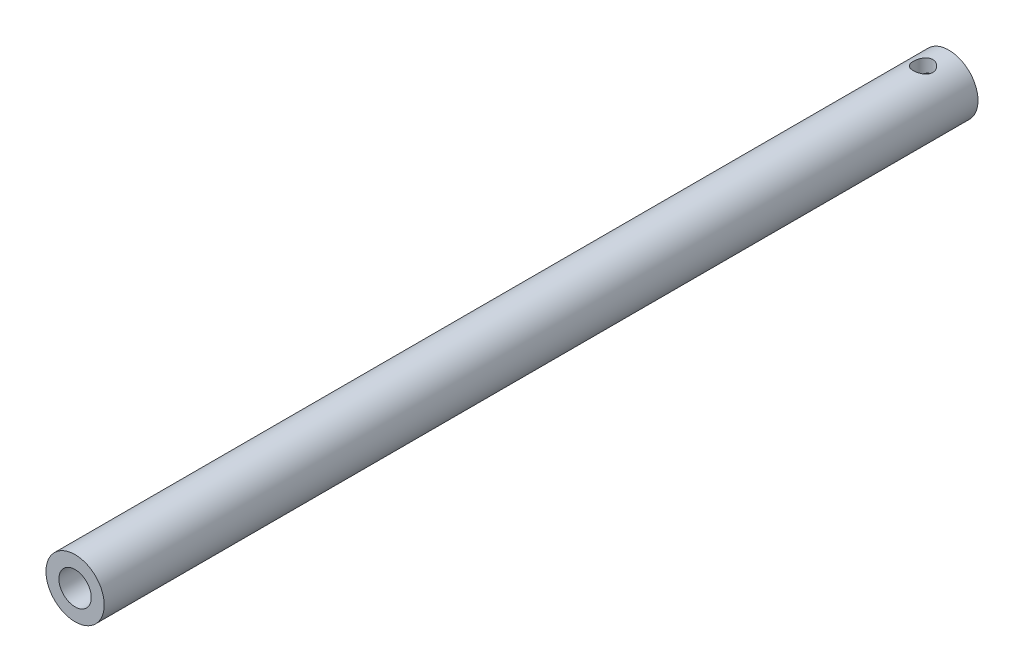
ISO-10303-21;
HEADER;
FILE_DESCRIPTION(('STEP AP214'),'2;1');
FILE_NAME('part.step','',(''),(''),'','','');
FILE_SCHEMA(('AUTOMOTIVE_DESIGN { 1 0 10303 214 1 1 1 1 }'));
ENDSEC;
DATA;
#1=APPLICATION_CONTEXT('core data for automotive mechanical design processes');
#2=APPLICATION_PROTOCOL_DEFINITION('international standard','automotive_design',2000,#1);
#3=PRODUCT_CONTEXT('',#1,'mechanical');
#4=PRODUCT('Part','Part','',(#3));
#5=PRODUCT_RELATED_PRODUCT_CATEGORY('part','',(#4));
#6=PRODUCT_DEFINITION_FORMATION('','',#4);
#7=PRODUCT_DEFINITION_CONTEXT('part definition',#1,'design');
#8=PRODUCT_DEFINITION('design','',#6,#7);
#9=PRODUCT_DEFINITION_SHAPE('','',#8);
#10=(LENGTH_UNIT() NAMED_UNIT(*) SI_UNIT(.MILLI.,.METRE.));
#11=(NAMED_UNIT(*) PLANE_ANGLE_UNIT() SI_UNIT($,.RADIAN.));
#12=(NAMED_UNIT(*) SI_UNIT($,.STERADIAN.) SOLID_ANGLE_UNIT());
#13=UNCERTAINTY_MEASURE_WITH_UNIT(LENGTH_MEASURE(1.E-05),#10,'distance_accuracy_value','');
#14=(GEOMETRIC_REPRESENTATION_CONTEXT(3) GLOBAL_UNCERTAINTY_ASSIGNED_CONTEXT((#13)) GLOBAL_UNIT_ASSIGNED_CONTEXT((#10,
#11,#12)) REPRESENTATION_CONTEXT('',''));
#15=CARTESIAN_POINT('',(0.,0.,0.));
#16=DIRECTION('',(0.,0.,1.));
#17=DIRECTION('',(1.,0.,0.));
#18=AXIS2_PLACEMENT_3D('',#15,#16,#17);
#19=CARTESIAN_POINT('',(0.,0.,270.));
#20=DIRECTION('',(0.,0.,1.));
#21=DIRECTION('',(1.,0.,0.));
#22=AXIS2_PLACEMENT_3D('',#19,#20,#21);
#23=PLANE('',#22);
#24=CARTESIAN_POINT('',(0.,0.,270.));
#25=DIRECTION('',(0.,0.,1.));
#26=DIRECTION('',(1.,0.,0.));
#27=AXIS2_PLACEMENT_3D('',#24,#25,#26);
#28=CIRCLE('',#27,9.);
#29=CARTESIAN_POINT('',(9.,0.,270.));
#30=VERTEX_POINT('',#29);
#31=EDGE_CURVE('E10',#30,#30,#28,.T.);
#32=ORIENTED_EDGE('',*,*,#31,.T.);
#33=EDGE_LOOP('',(#32));
#34=FACE_BOUND('',#33,.T.);
#35=CARTESIAN_POINT('',(0.,0.,270.));
#36=DIRECTION('',(0.,0.,1.));
#37=DIRECTION('',(1.,0.,0.));
#38=AXIS2_PLACEMENT_3D('',#35,#36,#37);
#39=CIRCLE('',#38,5.);
#40=CARTESIAN_POINT('',(5.,0.,270.));
#41=VERTEX_POINT('',#40);
#42=EDGE_CURVE('E58',#41,#41,#39,.T.);
#43=ORIENTED_EDGE('',*,*,#42,.F.);
#44=EDGE_LOOP('',(#43));
#45=FACE_BOUND('',#44,.T.);
#46=ADVANCED_FACE('F37',(#34,#45),#23,.T.);
#47=CARTESIAN_POINT('',(0.,0.,0.));
#48=DIRECTION('',(0.,0.,1.));
#49=DIRECTION('',(1.,0.,0.));
#50=AXIS2_PLACEMENT_3D('',#47,#48,#49);
#51=PLANE('',#50);
#52=CARTESIAN_POINT('',(0.,0.,0.));
#53=DIRECTION('',(0.,0.,1.));
#54=DIRECTION('',(1.,0.,0.));
#55=AXIS2_PLACEMENT_3D('',#52,#53,#54);
#56=CIRCLE('',#55,9.);
#57=CARTESIAN_POINT('',(9.,0.,0.));
#58=VERTEX_POINT('',#57);
#59=EDGE_CURVE('E52',#58,#58,#56,.T.);
#60=ORIENTED_EDGE('',*,*,#59,.F.);
#61=EDGE_LOOP('',(#60));
#62=FACE_BOUND('',#61,.T.);
#63=CARTESIAN_POINT('',(0.,0.,0.));
#64=DIRECTION('',(0.,0.,1.));
#65=DIRECTION('',(1.,0.,0.));
#66=AXIS2_PLACEMENT_3D('',#63,#64,#65);
#67=CIRCLE('',#66,5.);
#68=CARTESIAN_POINT('',(5.,0.,0.));
#69=VERTEX_POINT('',#68);
#70=EDGE_CURVE('E61',#69,#69,#67,.T.);
#71=ORIENTED_EDGE('',*,*,#70,.T.);
#72=EDGE_LOOP('',(#71));
#73=FACE_BOUND('',#72,.T.);
#74=ADVANCED_FACE('F102',(#62,#73),#51,.F.);
#75=CARTESIAN_POINT('',(0.,0.,270.));
#76=DIRECTION('',(0.,0.,-1.));
#77=DIRECTION('',(-1.,0.,0.));
#78=AXIS2_PLACEMENT_3D('',#75,#76,#77);
#79=CYLINDRICAL_SURFACE('',#78,9.);
#80=CARTESIAN_POINT('',(0.,-9.,11.));
#81=CARTESIAN_POINT('',(0.16369008866017,-9.00000045902832,11.0000007611949));
#82=CARTESIAN_POINT('',(0.32737558361565,-8.99549308522634,10.9865592016184));
#83=CARTESIAN_POINT('',(0.649925282618917,-8.97795630609842,10.9333126735483));
#84=CARTESIAN_POINT('',(0.808788984356453,-8.96492601606458,10.8935049681532));
#85=CARTESIAN_POINT('',(1.11699836850533,-8.93175923719328,10.7890422698479));
#86=CARTESIAN_POINT('',(1.2663594776581,-8.9116346319256,10.7244288126222));
#87=CARTESIAN_POINT('',(1.55212481041597,-8.86633337152025,10.572376481485));
#88=CARTESIAN_POINT('',(1.68852647087612,-8.84115572003334,10.4849331049922));
#89=CARTESIAN_POINT('',(1.9492250250668,-8.78742283329015,10.2865225854237));
#90=CARTESIAN_POINT('',(2.07301110089493,-8.75878669391354,10.1749062972185));
#91=CARTESIAN_POINT('',(2.30049807810625,-8.70180944349364,9.9326985358803));
#92=CARTESIAN_POINT('',(2.40419455646839,-8.67346839871647,9.80210289521446));
#93=CARTESIAN_POINT('',(2.59147482668358,-8.61939997431821,9.52104465441062));
#94=CARTESIAN_POINT('',(2.6743945746631,-8.59377117827064,9.37011878080363));
#95=CARTESIAN_POINT('',(2.81345662163316,-8.54925916255803,9.05547171662436));
#96=CARTESIAN_POINT('',(2.86960709216029,-8.53037388482237,8.89175444851177));
#97=CARTESIAN_POINT('',(2.95162038452749,-8.50233909808132,8.56198033550987));
#98=CARTESIAN_POINT('',(2.97844034481531,-8.49288287308834,8.39618837453281));
#99=CARTESIAN_POINT('',(3.00402337000343,-8.48386969888523,8.06220873753236));
#100=CARTESIAN_POINT('',(3.00279510481416,-8.4843096906819,7.89402181787243));
#101=CARTESIAN_POINT('',(2.97305971111026,-8.4947704502454,7.56819010866794));
#102=CARTESIAN_POINT('',(2.94580173950098,-8.50435247602599,7.41041479124294));
#103=CARTESIAN_POINT('',(2.86681848854825,-8.53129973173653,7.1018197411795));
#104=CARTESIAN_POINT('',(2.81509027977561,-8.54866589352323,6.95100084369479));
#105=CARTESIAN_POINT('',(2.68781717418063,-8.58953733393746,6.65776175122556));
#106=CARTESIAN_POINT('',(2.61190214612179,-8.61313697379352,6.51551592359142));
#107=CARTESIAN_POINT('',(2.43866731890942,-8.66377675727179,6.24538727516082));
#108=CARTESIAN_POINT('',(2.34134133709202,-8.69081789371391,6.11750861919986));
#109=CARTESIAN_POINT('',(2.12204799804671,-8.74701987503222,5.87272520551768));
#110=CARTESIAN_POINT('',(1.99905945022893,-8.77621768064528,5.75674191647279));
#111=CARTESIAN_POINT('',(1.73501870991019,-8.8322081516111,5.54680620000981));
#112=CARTESIAN_POINT('',(1.59396478698244,-8.85900058614202,5.45285588550651));
#113=CARTESIAN_POINT('',(1.2958428391388,-8.90751323813381,5.2889110992948));
#114=CARTESIAN_POINT('',(1.13862982924901,-8.92918050024118,5.2191635259778));
#115=CARTESIAN_POINT('',(0.813807250093524,-8.96461701433304,5.10739047813287));
#116=CARTESIAN_POINT('',(0.646201314464862,-8.97838900964638,5.06535537372969));
#117=CARTESIAN_POINT('',(0.313151488587913,-8.99602881214321,5.01183300193292));
#118=CARTESIAN_POINT('',(0.147928799594539,-9.00030005501184,4.99910057248175));
#119=CARTESIAN_POINT('',(-0.182325209880711,-8.99966708084482,5.00099802079541));
#120=CARTESIAN_POINT('',(-0.34735655795895,-8.99476441258087,5.01562327993963));
#121=CARTESIAN_POINT('',(-0.667559598912765,-8.97660074151313,5.07083572320788));
#122=CARTESIAN_POINT('',(-0.822878420504529,-8.96358596133577,5.11065861814848));
#123=CARTESIAN_POINT('',(-1.12456787573872,-8.9307554049021,5.21418033340018));
#124=CARTESIAN_POINT('',(-1.27093736552582,-8.91093876140025,5.27788219840336));
#125=CARTESIAN_POINT('',(-1.55486488917982,-8.86586793861869,5.42921129552236));
#126=CARTESIAN_POINT('',(-1.69208987765144,-8.84048444267358,5.51742377984951));
#127=CARTESIAN_POINT('',(-1.95019449040676,-8.78715761748787,5.71458245004045));
#128=CARTESIAN_POINT('',(-2.07106910338673,-8.75921350781483,5.82353496809529));
#129=CARTESIAN_POINT('',(-2.2987575234189,-8.70230543941334,6.06493625301976));
#130=CARTESIAN_POINT('',(-2.40468290773731,-8.67335283262284,6.19822768078058));
#131=CARTESIAN_POINT('',(-2.59277256697072,-8.61899919884126,6.48131470343266));
#132=CARTESIAN_POINT('',(-2.67493664379304,-8.59359820146007,6.63111043590223));
#133=CARTESIAN_POINT('',(-2.81279079124908,-8.54947175374151,6.94301904586969));
#134=CARTESIAN_POINT('',(-2.86853439649506,-8.53073282378936,7.1051062375063));
#135=CARTESIAN_POINT('',(-2.95168400027807,-8.50232496919349,7.43713595013239));
#136=CARTESIAN_POINT('',(-2.97910276486182,-8.49265195870918,7.60707489621305));
#137=CARTESIAN_POINT('',(-3.00382884743203,-8.48393576622531,7.94059128812275));
#138=CARTESIAN_POINT('',(-3.0026107719252,-8.48437200772245,8.10404702086047));
#139=CARTESIAN_POINT('',(-2.97372688034608,-8.49453809471602,8.42829522476619));
#140=CARTESIAN_POINT('',(-2.94606263837576,-8.50426738708085,8.58908785386527));
#141=CARTESIAN_POINT('',(-2.86611543938804,-8.53153572914675,8.90040698900741));
#142=CARTESIAN_POINT('',(-2.81431003804654,-8.54892294067433,9.05107047501349));
#143=CARTESIAN_POINT('',(-2.68793809727924,-8.58949196455405,9.34168222081481));
#144=CARTESIAN_POINT('',(-2.61336650566142,-8.61267506290179,9.48162809356402));
#145=CARTESIAN_POINT('',(-2.43978207775029,-8.66348487678138,9.75345100976873));
#146=CARTESIAN_POINT('',(-2.33984472829374,-8.69126134926411,9.88470950569516));
#147=CARTESIAN_POINT('',(-2.11992864940695,-8.74750068849758,10.1290694401526));
#148=CARTESIAN_POINT('',(-1.99994425335445,-8.77596374737117,10.2421657270642));
#149=CARTESIAN_POINT('',(-1.73772467076207,-8.83170091576632,10.4514332368675));
#150=CARTESIAN_POINT('',(-1.59480454049919,-8.8588854540377,10.546773043253));
#151=CARTESIAN_POINT('',(-1.29407207221988,-8.90777973517836,10.7119712865519));
#152=CARTESIAN_POINT('',(-1.13626355439705,-8.92949087723789,10.7818362377661));
#153=CARTESIAN_POINT('',(-0.817480941602928,-8.96416545205625,10.891164897466));
#154=CARTESIAN_POINT('',(-0.656963273029227,-8.97747637267568,10.9318473987901));
#155=CARTESIAN_POINT('',(-0.330961248030741,-8.99539221192665,10.9862608420314));
#156=CARTESIAN_POINT('',(-0.165478276706239,-8.99999953595715,10.9999992304896));
#157=CARTESIAN_POINT('',(0.,-9.,11.));
#158=B_SPLINE_CURVE_WITH_KNOTS('',3,(#80,#81,#82,#83,#84,#85,#86,#87,#88,#89,#90,#91,#92,#93,
#94,#95,#96,#97,#98,#99,#100,#101,#102,#103,#104,#105,#106,#107,#108,#109,#110,#111,#112,#113,
#114,#115,#116,#117,#118,#119,#120,#121,#122,#123,#124,#125,#126,#127,#128,#129,#130,#131,#132,
#133,#134,#135,#136,#137,#138,#139,#140,#141,#142,#143,#144,#145,#146,#147,#148,#149,#150,#151,
#152,#153,#154,#155,#156,#157),.UNSPECIFIED.,.T.,.F.,(4,2,2,2,2,2,2,2,2,2,2,2,2,2,2,2,2,2,2,2,2,
2,2,2,2,2,2,2,2,2,2,2,2,2,2,2,2,2,4),(0.,0.490461318078033,0.980973555802562,1.47066801861082,
1.9604591333973,2.46554052848268,2.97073299862591,3.49045154470412,4.010011340785,
4.5120577722552,5.01394901962456,5.49290479653841,5.97191792566446,6.45864513465392,
6.94551307674622,7.45779917434101,7.97013437899855,8.48755216951073,9.00479006631625,
9.49960749525509,9.9943413949253,10.4747447393464,10.9552093585231,11.4483119953121,
11.9415654246567,12.4572306864226,12.9729002470499,13.4875204148031,14.0019085411752,
14.4898699819277,14.9778023805413,15.4564676124125,15.9352391452793,16.4349020007541,
16.9347063337134,17.453989825053,17.9731404345737,18.4690967512144,18.9649159811442),.UNSPECIFIED.);
#159=CARTESIAN_POINT('',(0.,-9.,11.));
#160=VERTEX_POINT('',#159);
#161=EDGE_CURVE('E88',#160,#160,#158,.T.);
#162=ORIENTED_EDGE('',*,*,#161,.T.);
#163=EDGE_LOOP('',(#162));
#164=FACE_BOUND('',#163,.T.);
#165=CARTESIAN_POINT('',(0.,9.,11.));
#166=CARTESIAN_POINT('',(-0.16369008866017,9.00000045902832,11.0000007611949));
#167=CARTESIAN_POINT('',(-0.32737558361565,8.99549308522634,10.9865592016184));
#168=CARTESIAN_POINT('',(-0.649925282618917,8.97795630609842,10.9333126735483));
#169=CARTESIAN_POINT('',(-0.808788984356453,8.96492601606458,10.8935049681532));
#170=CARTESIAN_POINT('',(-1.11699836850533,8.93175923719328,10.7890422698479));
#171=CARTESIAN_POINT('',(-1.2663594776581,8.9116346319256,10.7244288126222));
#172=CARTESIAN_POINT('',(-1.55212481041597,8.86633337152025,10.572376481485));
#173=CARTESIAN_POINT('',(-1.68852647087612,8.84115572003334,10.4849331049922));
#174=CARTESIAN_POINT('',(-1.9492250250668,8.78742283329015,10.2865225854237));
#175=CARTESIAN_POINT('',(-2.07301110089493,8.75878669391354,10.1749062972185));
#176=CARTESIAN_POINT('',(-2.30049807810625,8.70180944349364,9.9326985358803));
#177=CARTESIAN_POINT('',(-2.40419455646839,8.67346839871647,9.80210289521446));
#178=CARTESIAN_POINT('',(-2.59147482668358,8.61939997431821,9.52104465441062));
#179=CARTESIAN_POINT('',(-2.6743945746631,8.59377117827064,9.37011878080363));
#180=CARTESIAN_POINT('',(-2.81345662163316,8.54925916255803,9.05547171662436));
#181=CARTESIAN_POINT('',(-2.86960709216029,8.53037388482237,8.89175444851177));
#182=CARTESIAN_POINT('',(-2.95162038452749,8.50233909808132,8.56198033550987));
#183=CARTESIAN_POINT('',(-2.97844034481531,8.49288287308834,8.39618837453281));
#184=CARTESIAN_POINT('',(-3.00402337000343,8.48386969888523,8.06220873753236));
#185=CARTESIAN_POINT('',(-3.00279510481416,8.4843096906819,7.89402181787243));
#186=CARTESIAN_POINT('',(-2.97305971111026,8.4947704502454,7.56819010866794));
#187=CARTESIAN_POINT('',(-2.94580173950098,8.50435247602599,7.41041479124294));
#188=CARTESIAN_POINT('',(-2.86681848854825,8.53129973173653,7.1018197411795));
#189=CARTESIAN_POINT('',(-2.81509027977561,8.54866589352323,6.95100084369479));
#190=CARTESIAN_POINT('',(-2.68781717418063,8.58953733393746,6.65776175122556));
#191=CARTESIAN_POINT('',(-2.61190214612179,8.61313697379352,6.51551592359142));
#192=CARTESIAN_POINT('',(-2.43866731890942,8.66377675727179,6.24538727516082));
#193=CARTESIAN_POINT('',(-2.34134133709202,8.69081789371391,6.11750861919986));
#194=CARTESIAN_POINT('',(-2.12204799804671,8.74701987503222,5.87272520551768));
#195=CARTESIAN_POINT('',(-1.99905945022893,8.77621768064528,5.75674191647279));
#196=CARTESIAN_POINT('',(-1.73501870991019,8.8322081516111,5.54680620000981));
#197=CARTESIAN_POINT('',(-1.59396478698244,8.85900058614202,5.45285588550651));
#198=CARTESIAN_POINT('',(-1.2958428391388,8.90751323813381,5.2889110992948));
#199=CARTESIAN_POINT('',(-1.13862982924901,8.92918050024118,5.2191635259778));
#200=CARTESIAN_POINT('',(-0.813807250093524,8.96461701433304,5.10739047813287));
#201=CARTESIAN_POINT('',(-0.646201314464862,8.97838900964638,5.06535537372969));
#202=CARTESIAN_POINT('',(-0.313151488587913,8.99602881214321,5.01183300193292));
#203=CARTESIAN_POINT('',(-0.147928799594539,9.00030005501184,4.99910057248175));
#204=CARTESIAN_POINT('',(0.182325209880711,8.99966708084482,5.00099802079541));
#205=CARTESIAN_POINT('',(0.34735655795895,8.99476441258087,5.01562327993963));
#206=CARTESIAN_POINT('',(0.667559598912765,8.97660074151313,5.07083572320788));
#207=CARTESIAN_POINT('',(0.822878420504529,8.96358596133577,5.11065861814848));
#208=CARTESIAN_POINT('',(1.12456787573872,8.9307554049021,5.21418033340018));
#209=CARTESIAN_POINT('',(1.27093736552582,8.91093876140025,5.27788219840336));
#210=CARTESIAN_POINT('',(1.55486488917982,8.86586793861869,5.42921129552236));
#211=CARTESIAN_POINT('',(1.69208987765144,8.84048444267358,5.51742377984951));
#212=CARTESIAN_POINT('',(1.95019449040676,8.78715761748787,5.71458245004045));
#213=CARTESIAN_POINT('',(2.07106910338673,8.75921350781483,5.82353496809529));
#214=CARTESIAN_POINT('',(2.2987575234189,8.70230543941334,6.06493625301976));
#215=CARTESIAN_POINT('',(2.40468290773731,8.67335283262284,6.19822768078058));
#216=CARTESIAN_POINT('',(2.59277256697072,8.61899919884126,6.48131470343266));
#217=CARTESIAN_POINT('',(2.67493664379304,8.59359820146007,6.63111043590223));
#218=CARTESIAN_POINT('',(2.81279079124908,8.54947175374151,6.94301904586969));
#219=CARTESIAN_POINT('',(2.86853439649506,8.53073282378936,7.1051062375063));
#220=CARTESIAN_POINT('',(2.95168400027807,8.50232496919349,7.43713595013239));
#221=CARTESIAN_POINT('',(2.97910276486182,8.49265195870918,7.60707489621305));
#222=CARTESIAN_POINT('',(3.00382884743203,8.48393576622531,7.94059128812275));
#223=CARTESIAN_POINT('',(3.0026107719252,8.48437200772245,8.10404702086047));
#224=CARTESIAN_POINT('',(2.97372688034608,8.49453809471602,8.42829522476619));
#225=CARTESIAN_POINT('',(2.94606263837576,8.50426738708085,8.58908785386527));
#226=CARTESIAN_POINT('',(2.86611543938804,8.53153572914675,8.90040698900741));
#227=CARTESIAN_POINT('',(2.81431003804654,8.54892294067433,9.05107047501349));
#228=CARTESIAN_POINT('',(2.68793809727924,8.58949196455405,9.34168222081481));
#229=CARTESIAN_POINT('',(2.61336650566142,8.61267506290179,9.48162809356402));
#230=CARTESIAN_POINT('',(2.43978207775029,8.66348487678138,9.75345100976873));
#231=CARTESIAN_POINT('',(2.33984472829374,8.69126134926411,9.88470950569516));
#232=CARTESIAN_POINT('',(2.11992864940695,8.74750068849758,10.1290694401526));
#233=CARTESIAN_POINT('',(1.99994425335445,8.77596374737117,10.2421657270642));
#234=CARTESIAN_POINT('',(1.73772467076207,8.83170091576632,10.4514332368675));
#235=CARTESIAN_POINT('',(1.59480454049919,8.8588854540377,10.546773043253));
#236=CARTESIAN_POINT('',(1.29407207221988,8.90777973517836,10.7119712865519));
#237=CARTESIAN_POINT('',(1.13626355439705,8.92949087723789,10.7818362377661));
#238=CARTESIAN_POINT('',(0.817480941602928,8.96416545205625,10.891164897466));
#239=CARTESIAN_POINT('',(0.656963273029227,8.97747637267568,10.9318473987901));
#240=CARTESIAN_POINT('',(0.330961248030741,8.99539221192665,10.9862608420314));
#241=CARTESIAN_POINT('',(0.165478276706239,8.99999953595715,10.9999992304896));
#242=CARTESIAN_POINT('',(0.,9.,11.));
#243=B_SPLINE_CURVE_WITH_KNOTS('',3,(#165,#166,#167,#168,#169,#170,#171,#172,#173,#174,#175,
#176,#177,#178,#179,#180,#181,#182,#183,#184,#185,#186,#187,#188,#189,#190,#191,#192,#193,#194,
#195,#196,#197,#198,#199,#200,#201,#202,#203,#204,#205,#206,#207,#208,#209,#210,#211,#212,#213,
#214,#215,#216,#217,#218,#219,#220,#221,#222,#223,#224,#225,#226,#227,#228,#229,#230,#231,#232,
#233,#234,#235,#236,#237,#238,#239,#240,#241,#242),.UNSPECIFIED.,.T.,.F.,(4,2,2,2,2,2,2,2,2,2,2,
2,2,2,2,2,2,2,2,2,2,2,2,2,2,2,2,2,2,2,2,2,2,2,2,2,2,2,4),(0.,0.490461318078033,
0.980973555802562,1.47066801861082,1.9604591333973,2.46554052848268,2.97073299862591,
3.49045154470412,4.010011340785,4.5120577722552,5.01394901962456,5.49290479653841,
5.97191792566446,6.45864513465392,6.94551307674622,7.45779917434101,7.97013437899855,
8.48755216951073,9.00479006631625,9.49960749525509,9.9943413949253,10.4747447393464,
10.9552093585231,11.4483119953121,11.9415654246567,12.4572306864226,12.9729002470499,
13.4875204148031,14.0019085411752,14.4898699819277,14.9778023805413,15.4564676124125,
15.9352391452793,16.4349020007541,16.9347063337134,17.453989825053,17.9731404345737,
18.4690967512144,18.9649159811442),.UNSPECIFIED.);
#244=CARTESIAN_POINT('',(0.,9.,11.));
#245=VERTEX_POINT('',#244);
#246=EDGE_CURVE('E82',#245,#245,#243,.T.);
#247=ORIENTED_EDGE('',*,*,#246,.T.);
#248=EDGE_LOOP('',(#247));
#249=FACE_BOUND('',#248,.T.);
#250=ORIENTED_EDGE('',*,*,#31,.F.);
#251=EDGE_LOOP('',(#250));
#252=FACE_BOUND('',#251,.T.);
#253=ORIENTED_EDGE('',*,*,#59,.T.);
#254=EDGE_LOOP('',(#253));
#255=FACE_BOUND('',#254,.T.);
#256=ADVANCED_FACE('F39',(#164,#249,#252,#255),#79,.T.);
#257=CARTESIAN_POINT('',(0.,0.,270.));
#258=DIRECTION('',(0.,0.,-1.));
#259=DIRECTION('',(-1.,0.,0.));
#260=AXIS2_PLACEMENT_3D('',#257,#258,#259);
#261=CYLINDRICAL_SURFACE('',#260,5.);
#262=CARTESIAN_POINT('',(0.,-5.,11.));
#263=CARTESIAN_POINT('',(0.0767697294351705,-4.99999907546385,10.9999989437555));
#264=CARTESIAN_POINT('',(0.153562134518387,-4.99822567812271,10.9970464064299));
#265=CARTESIAN_POINT('',(0.306548487758715,-4.99118362570631,10.9852857670203));
#266=CARTESIAN_POINT('',(0.382742059346592,-4.98591292553957,10.9764742388118));
#267=CARTESIAN_POINT('',(0.609808130024627,-4.96499345352549,10.9413514405369));
#268=CARTESIAN_POINT('',(0.758981863291667,-4.94423772571335,10.9063522975666));
#269=CARTESIAN_POINT('',(1.04754167363585,-4.89123238995897,10.8152272564959));
#270=CARTESIAN_POINT('',(1.18697226741342,-4.8590397955111,10.7592060779873));
#271=CARTESIAN_POINT('',(1.45405042800218,-4.7859070225578,10.628279339403));
#272=CARTESIAN_POINT('',(1.58170090938261,-4.74496901614699,10.5533784676398));
#273=CARTESIAN_POINT('',(1.83260160381823,-4.65410731283371,10.3804503448849));
#274=CARTESIAN_POINT('',(1.95476885986166,-4.60373587041895,10.2810926088335));
#275=CARTESIAN_POINT('',(2.1817645874806,-4.50060875905921,10.0650655928078));
#276=CARTESIAN_POINT('',(2.28657046750404,-4.4478500955754,9.94837412578165));
#277=CARTESIAN_POINT('',(2.48890019509838,-4.33822134833335,9.68415297883109));
#278=CARTESIAN_POINT('',(2.5839553962784,-4.28164035635797,9.53459645787782));
#279=CARTESIAN_POINT('',(2.74722868670786,-4.17876602596121,9.21830685367312));
#280=CARTESIAN_POINT('',(2.8154903315581,-4.13245604474886,9.05160220796684));
#281=CARTESIAN_POINT('',(2.90881204577224,-4.06709259377223,8.7468070983431));
#282=CARTESIAN_POINT('',(2.94032394587637,-4.04415766338645,8.61152800163861));
#283=CARTESIAN_POINT('',(2.98432344587083,-4.01180616527621,8.33639256947861));
#284=CARTESIAN_POINT('',(2.99683469884359,-4.00237279089368,8.19654214669596));
#285=CARTESIAN_POINT('',(3.0021101681982,-3.99841845126251,7.91597700735214));
#286=CARTESIAN_POINT('',(2.99483563630785,-4.00392674756739,7.77526113408813));
#287=CARTESIAN_POINT('',(2.96092124146105,-4.02906522155629,7.49744246488214));
#288=CARTESIAN_POINT('',(2.93426681225441,-4.04870602134773,7.36034246705851));
#289=CARTESIAN_POINT('',(2.86347831933193,-4.09906376582929,7.09493945774946));
#290=CARTESIAN_POINT('',(2.8195745342289,-4.12963433300037,6.96654567700555));
#291=CARTESIAN_POINT('',(2.71590167467071,-4.19854092703026,6.7186102333682));
#292=CARTESIAN_POINT('',(2.65612678414159,-4.2368797994146,6.59907183617098));
#293=CARTESIAN_POINT('',(2.51035773820671,-4.32510698365562,6.35003086234366));
#294=CARTESIAN_POINT('',(2.42160671901867,-4.3758426358075,6.22244000763227));
#295=CARTESIAN_POINT('',(2.22582963207776,-4.4786102252415,5.98265084277988));
#296=CARTESIAN_POINT('',(2.11878609335504,-4.53064336077654,5.87046743459787));
#297=CARTESIAN_POINT('',(1.87159040921357,-4.63871766962914,5.64875774055151));
#298=CARTESIAN_POINT('',(1.72890315178768,-4.69430681953073,5.54178060876265));
#299=CARTESIAN_POINT('',(1.50061053630278,-4.77018325995047,5.40073128727714));
#300=CARTESIAN_POINT('',(1.42209821815681,-4.79423315237468,5.35693586448389));
#301=CARTESIAN_POINT('',(1.26074368673913,-4.83916496756429,5.276281176389));
#302=CARTESIAN_POINT('',(1.17790417501175,-4.86004883588963,5.23941764797919));
#303=CARTESIAN_POINT('',(1.01376371174,-4.8968267274493,5.17518855714336));
#304=CARTESIAN_POINT('',(0.932690066663955,-4.91295100454953,5.14737343955079));
#305=CARTESIAN_POINT('',(0.767879949732825,-4.94139126794745,5.09866604415477));
#306=CARTESIAN_POINT('',(0.684144997174636,-4.95370938553284,5.07776989155364));
#307=CARTESIAN_POINT('',(0.514744462654422,-4.97416370514887,5.04322814527524));
#308=CARTESIAN_POINT('',(0.429080341969608,-4.98230296820872,5.02957724417139));
#309=CARTESIAN_POINT('',(0.256621746592204,-4.99415996414414,5.0097338156098));
#310=CARTESIAN_POINT('',(0.169827432617757,-4.99787831889699,5.00354023914868));
#311=CARTESIAN_POINT('',(-0.0673242571106457,-5.00179157954795,4.99700732971637));
#312=CARTESIAN_POINT('',(-0.218056842610664,-4.99746512571837,5.0041884543694));
#313=CARTESIAN_POINT('',(-0.515686907629,-4.97557955020067,5.0408455417291));
#314=CARTESIAN_POINT('',(-0.662584464852968,-4.95802069684413,5.07032105234186));
#315=CARTESIAN_POINT('',(-0.945142599254815,-4.91189447655688,5.14908845918428));
#316=CARTESIAN_POINT('',(-1.08098954856944,-4.88360514429733,5.19788112659201));
#317=CARTESIAN_POINT('',(-1.34253345184752,-4.81827798628348,5.31335432420091));
#318=CARTESIAN_POINT('',(-1.46822839746276,-4.78123843515362,5.38003838259407));
#319=CARTESIAN_POINT('',(-1.7200119213015,-4.69690981059277,5.53711409097797));
#320=CARTESIAN_POINT('',(-1.84478813824221,-4.6489560240695,5.62924769383748));
#321=CARTESIAN_POINT('',(-2.07805222548222,-4.54948534225871,5.83078275125476));
#322=CARTESIAN_POINT('',(-2.18652085154156,-4.49796434043363,5.94020429960271));
#323=CARTESIAN_POINT('',(-2.39863988264158,-4.38890846835682,6.18982079149316));
#324=CARTESIAN_POINT('',(-2.49982037884172,-4.33146483230154,6.33216777394304));
#325=CARTESIAN_POINT('',(-2.67690479207535,-4.22432364395571,6.63443204612756));
#326=CARTESIAN_POINT('',(-2.75283533845462,-4.1746179606141,6.79433058715125));
#327=CARTESIAN_POINT('',(-2.86285157351706,-4.09969818429266,7.09248604511072));
#328=CARTESIAN_POINT('',(-2.90243250662613,-4.07151318633887,7.22796062464204));
#329=CARTESIAN_POINT('',(-2.96227327821697,-4.02819211510624,7.50506415623523));
#330=CARTESIAN_POINT('',(-2.98255990395067,-4.01303795327895,7.64668428945152));
#331=CARTESIAN_POINT('',(-3.00268261034206,-3.99800893189922,7.93275389439522));
#332=CARTESIAN_POINT('',(-3.00244179030845,-3.99819152744816,8.0772119782483));
#333=CARTESIAN_POINT('',(-2.98132945103105,-4.01395435932838,8.3637888743464));
#334=CARTESIAN_POINT('',(-2.96044671369591,-4.02954296823692,8.50590637187481));
#335=CARTESIAN_POINT('',(-2.90080351212233,-4.07266369966216,8.7769768239951));
#336=CARTESIAN_POINT('',(-2.86295284328648,-4.09958421715569,8.90623414792436));
#337=CARTESIAN_POINT('',(-2.77126473512031,-4.16211005816609,9.15667454965315));
#338=CARTESIAN_POINT('',(-2.7174212751772,-4.19771865147484,9.27785456561299));
#339=CARTESIAN_POINT('',(-2.58578536859698,-4.28025972950371,9.52863953945999));
#340=CARTESIAN_POINT('',(-2.50558518231556,-4.32809142579694,9.65668150821477));
#341=CARTESIAN_POINT('',(-2.32751213746957,-4.42640286674054,9.8987608453066));
#342=CARTESIAN_POINT('',(-2.22962472612067,-4.47688476749087,10.0127865504795));
#343=CARTESIAN_POINT('',(-2.00020353552556,-4.5845123827036,10.2426988433295));
#344=CARTESIAN_POINT('',(-1.86578571790514,-4.64140045738634,10.3558498798616));
#345=CARTESIAN_POINT('',(-1.57689277813436,-4.74731429537958,10.5582079860481));
#346=CARTESIAN_POINT('',(-1.42241049573676,-4.79633723789531,10.6474064729197));
#347=CARTESIAN_POINT('',(-1.18102189661686,-4.85920558314903,10.7591244741905));
#348=CARTESIAN_POINT('',(-1.10025014285136,-4.87817139185349,10.7923359959645));
#349=CARTESIAN_POINT('',(-0.935442217988387,-4.91243413775203,10.8517721381435));
#350=CARTESIAN_POINT('',(-0.8514079847881,-4.9277332153652,10.8780008357009));
#351=CARTESIAN_POINT('',(-0.681001816074564,-4.95415527987996,10.9230094420757));
#352=CARTESIAN_POINT('',(-0.59463750060929,-4.9652904423195,10.9418110773033));
#353=CARTESIAN_POINT('',(-0.42018374602076,-4.98308318645254,10.971744355323));
#354=CARTESIAN_POINT('',(-0.332095806784395,-4.98974449723791,10.9828823861533));
#355=CARTESIAN_POINT('',(-0.203123929661336,-4.99603728421477,10.9933916838053));
#356=CARTESIAN_POINT('',(-0.162556281113487,-4.99752198179196,10.995868430454));
#357=CARTESIAN_POINT('',(-0.0813278781867668,-4.99950360169341,10.9991728969139));
#358=CARTESIAN_POINT('',(-0.0406671206271713,-5.00000048975323,11.0000005595229));
#359=CARTESIAN_POINT('',(0.,-5.,11.));
#360=B_SPLINE_CURVE_WITH_KNOTS('',3,(#262,#263,#264,#265,#266,#267,#268,#269,#270,#271,#272,
#273,#274,#275,#276,#277,#278,#279,#280,#281,#282,#283,#284,#285,#286,#287,#288,#289,#290,#291,
#292,#293,#294,#295,#296,#297,#298,#299,#300,#301,#302,#303,#304,#305,#306,#307,#308,#309,#310,
#311,#312,#313,#314,#315,#316,#317,#318,#319,#320,#321,#322,#323,#324,#325,#326,#327,#328,#329,
#330,#331,#332,#333,#334,#335,#336,#337,#338,#339,#340,#341,#342,#343,#344,#345,#346,#347,#348,
#349,#350,#351,#352,#353,#354,#355,#356,#357,#358,#359),.UNSPECIFIED.,.T.,.F.,(4,2,2,2,2,2,2,2,
2,2,2,2,2,2,2,2,2,2,2,2,2,2,2,2,2,2,2,2,2,2,2,2,2,2,2,2,2,2,2,2,2,2,2,2,2,2,2,2,4),(0.,
0.230263300595002,0.4606613693334,0.922002149276126,1.38107466343613,1.84003329022065,
2.33408870888555,2.82878205293211,3.38413315803225,3.93857770807793,4.35913349134877,
4.77916531256766,5.20002031165062,5.62119195971355,6.03692224610024,6.45280509043347,
6.94139679873935,7.43045779030959,7.98767605192992,8.26653157143431,8.54521503013734,
8.80648473589063,9.06760787545943,9.3285394673096,9.58943435026958,10.0398406663534,
10.490237849174,10.9296843257003,11.3692175250854,11.8543559282721,12.3400624135416,
12.889063860465,13.437484464234,13.8674843581987,14.2968863865712,14.7278971274535,
15.1591422350194,15.5696105785277,15.9802336423656,16.4539008129506,16.927959499309,
17.4794148474152,18.0310675325446,18.2988384573895,18.5664526907294,18.8332781687618,
19.0998809626714,19.221853785686,19.3438308395353),.UNSPECIFIED.);
#361=CARTESIAN_POINT('',(0.,-5.,11.));
#362=VERTEX_POINT('',#361);
#363=EDGE_CURVE('E42',#362,#362,#360,.T.);
#364=ORIENTED_EDGE('',*,*,#363,.F.);
#365=EDGE_LOOP('',(#364));
#366=FACE_BOUND('',#365,.T.);
#367=CARTESIAN_POINT('',(0.,5.,11.));
#368=CARTESIAN_POINT('',(-0.0767697294351705,4.99999907546385,10.9999989437555));
#369=CARTESIAN_POINT('',(-0.153562134518387,4.99822567812271,10.9970464064299));
#370=CARTESIAN_POINT('',(-0.306548487758715,4.99118362570631,10.9852857670203));
#371=CARTESIAN_POINT('',(-0.382742059346592,4.98591292553957,10.9764742388118));
#372=CARTESIAN_POINT('',(-0.609808130024627,4.96499345352549,10.9413514405369));
#373=CARTESIAN_POINT('',(-0.758981863291667,4.94423772571335,10.9063522975666));
#374=CARTESIAN_POINT('',(-1.04754167363585,4.89123238995897,10.8152272564959));
#375=CARTESIAN_POINT('',(-1.18697226741342,4.8590397955111,10.7592060779873));
#376=CARTESIAN_POINT('',(-1.45405042800218,4.7859070225578,10.628279339403));
#377=CARTESIAN_POINT('',(-1.58170090938261,4.74496901614699,10.5533784676398));
#378=CARTESIAN_POINT('',(-1.83260160381823,4.65410731283371,10.3804503448849));
#379=CARTESIAN_POINT('',(-1.95476885986166,4.60373587041895,10.2810926088335));
#380=CARTESIAN_POINT('',(-2.1817645874806,4.50060875905921,10.0650655928078));
#381=CARTESIAN_POINT('',(-2.28657046750404,4.4478500955754,9.94837412578165));
#382=CARTESIAN_POINT('',(-2.48890019509838,4.33822134833335,9.68415297883109));
#383=CARTESIAN_POINT('',(-2.5839553962784,4.28164035635797,9.53459645787782));
#384=CARTESIAN_POINT('',(-2.74722868670786,4.17876602596121,9.21830685367312));
#385=CARTESIAN_POINT('',(-2.8154903315581,4.13245604474886,9.05160220796684));
#386=CARTESIAN_POINT('',(-2.90881204577224,4.06709259377223,8.7468070983431));
#387=CARTESIAN_POINT('',(-2.94032394587637,4.04415766338645,8.61152800163861));
#388=CARTESIAN_POINT('',(-2.98432344587083,4.01180616527621,8.33639256947861));
#389=CARTESIAN_POINT('',(-2.99683469884359,4.00237279089368,8.19654214669596));
#390=CARTESIAN_POINT('',(-3.0021101681982,3.99841845126251,7.91597700735214));
#391=CARTESIAN_POINT('',(-2.99483563630785,4.00392674756739,7.77526113408813));
#392=CARTESIAN_POINT('',(-2.96092124146105,4.02906522155629,7.49744246488214));
#393=CARTESIAN_POINT('',(-2.93426681225441,4.04870602134773,7.36034246705851));
#394=CARTESIAN_POINT('',(-2.86347831933193,4.09906376582929,7.09493945774946));
#395=CARTESIAN_POINT('',(-2.8195745342289,4.12963433300037,6.96654567700555));
#396=CARTESIAN_POINT('',(-2.71590167467071,4.19854092703026,6.7186102333682));
#397=CARTESIAN_POINT('',(-2.65612678414159,4.2368797994146,6.59907183617098));
#398=CARTESIAN_POINT('',(-2.51035773820671,4.32510698365562,6.35003086234366));
#399=CARTESIAN_POINT('',(-2.42160671901867,4.3758426358075,6.22244000763227));
#400=CARTESIAN_POINT('',(-2.22582963207776,4.4786102252415,5.98265084277988));
#401=CARTESIAN_POINT('',(-2.11878609335504,4.53064336077654,5.87046743459787));
#402=CARTESIAN_POINT('',(-1.87159040921357,4.63871766962914,5.64875774055151));
#403=CARTESIAN_POINT('',(-1.72890315178768,4.69430681953073,5.54178060876265));
#404=CARTESIAN_POINT('',(-1.50061053630278,4.77018325995047,5.40073128727714));
#405=CARTESIAN_POINT('',(-1.42209821815681,4.79423315237468,5.35693586448389));
#406=CARTESIAN_POINT('',(-1.26074368673913,4.83916496756429,5.276281176389));
#407=CARTESIAN_POINT('',(-1.17790417501175,4.86004883588963,5.23941764797919));
#408=CARTESIAN_POINT('',(-1.01376371174,4.8968267274493,5.17518855714336));
#409=CARTESIAN_POINT('',(-0.932690066663955,4.91295100454953,5.14737343955079));
#410=CARTESIAN_POINT('',(-0.767879949732825,4.94139126794745,5.09866604415477));
#411=CARTESIAN_POINT('',(-0.684144997174636,4.95370938553284,5.07776989155364));
#412=CARTESIAN_POINT('',(-0.514744462654422,4.97416370514887,5.04322814527524));
#413=CARTESIAN_POINT('',(-0.429080341969608,4.98230296820872,5.02957724417139));
#414=CARTESIAN_POINT('',(-0.256621746592204,4.99415996414414,5.0097338156098));
#415=CARTESIAN_POINT('',(-0.169827432617757,4.99787831889699,5.00354023914868));
#416=CARTESIAN_POINT('',(0.0673242571106457,5.00179157954795,4.99700732971637));
#417=CARTESIAN_POINT('',(0.218056842610664,4.99746512571837,5.0041884543694));
#418=CARTESIAN_POINT('',(0.515686907629,4.97557955020067,5.0408455417291));
#419=CARTESIAN_POINT('',(0.662584464852968,4.95802069684413,5.07032105234186));
#420=CARTESIAN_POINT('',(0.945142599254815,4.91189447655688,5.14908845918428));
#421=CARTESIAN_POINT('',(1.08098954856944,4.88360514429733,5.19788112659201));
#422=CARTESIAN_POINT('',(1.34253345184752,4.81827798628348,5.31335432420091));
#423=CARTESIAN_POINT('',(1.46822839746276,4.78123843515362,5.38003838259407));
#424=CARTESIAN_POINT('',(1.7200119213015,4.69690981059277,5.53711409097797));
#425=CARTESIAN_POINT('',(1.84478813824221,4.6489560240695,5.62924769383748));
#426=CARTESIAN_POINT('',(2.07805222548222,4.54948534225871,5.83078275125476));
#427=CARTESIAN_POINT('',(2.18652085154156,4.49796434043363,5.94020429960271));
#428=CARTESIAN_POINT('',(2.39863988264158,4.38890846835682,6.18982079149316));
#429=CARTESIAN_POINT('',(2.49982037884172,4.33146483230154,6.33216777394304));
#430=CARTESIAN_POINT('',(2.67690479207535,4.22432364395571,6.63443204612756));
#431=CARTESIAN_POINT('',(2.75283533845462,4.1746179606141,6.79433058715125));
#432=CARTESIAN_POINT('',(2.86285157351706,4.09969818429266,7.09248604511072));
#433=CARTESIAN_POINT('',(2.90243250662613,4.07151318633887,7.22796062464204));
#434=CARTESIAN_POINT('',(2.96227327821697,4.02819211510624,7.50506415623523));
#435=CARTESIAN_POINT('',(2.98255990395067,4.01303795327895,7.64668428945152));
#436=CARTESIAN_POINT('',(3.00268261034206,3.99800893189922,7.93275389439522));
#437=CARTESIAN_POINT('',(3.00244179030845,3.99819152744816,8.0772119782483));
#438=CARTESIAN_POINT('',(2.98132945103105,4.01395435932838,8.3637888743464));
#439=CARTESIAN_POINT('',(2.96044671369591,4.02954296823692,8.50590637187481));
#440=CARTESIAN_POINT('',(2.90080351212233,4.07266369966216,8.7769768239951));
#441=CARTESIAN_POINT('',(2.86295284328648,4.09958421715569,8.90623414792436));
#442=CARTESIAN_POINT('',(2.77126473512031,4.16211005816609,9.15667454965315));
#443=CARTESIAN_POINT('',(2.7174212751772,4.19771865147484,9.27785456561299));
#444=CARTESIAN_POINT('',(2.58578536859698,4.28025972950371,9.52863953945999));
#445=CARTESIAN_POINT('',(2.50558518231556,4.32809142579694,9.65668150821477));
#446=CARTESIAN_POINT('',(2.32751213746957,4.42640286674054,9.8987608453066));
#447=CARTESIAN_POINT('',(2.22962472612067,4.47688476749087,10.0127865504795));
#448=CARTESIAN_POINT('',(2.00020353552556,4.5845123827036,10.2426988433295));
#449=CARTESIAN_POINT('',(1.86578571790514,4.64140045738634,10.3558498798616));
#450=CARTESIAN_POINT('',(1.57689277813436,4.74731429537958,10.5582079860481));
#451=CARTESIAN_POINT('',(1.42241049573676,4.79633723789531,10.6474064729197));
#452=CARTESIAN_POINT('',(1.18102189661686,4.85920558314903,10.7591244741905));
#453=CARTESIAN_POINT('',(1.10025014285136,4.87817139185349,10.7923359959645));
#454=CARTESIAN_POINT('',(0.935442217988387,4.91243413775203,10.8517721381435));
#455=CARTESIAN_POINT('',(0.8514079847881,4.9277332153652,10.8780008357009));
#456=CARTESIAN_POINT('',(0.681001816074564,4.95415527987996,10.9230094420757));
#457=CARTESIAN_POINT('',(0.59463750060929,4.9652904423195,10.9418110773033));
#458=CARTESIAN_POINT('',(0.42018374602076,4.98308318645254,10.971744355323));
#459=CARTESIAN_POINT('',(0.332095806784395,4.98974449723791,10.9828823861533));
#460=CARTESIAN_POINT('',(0.203123929661336,4.99603728421477,10.9933916838053));
#461=CARTESIAN_POINT('',(0.162556281113487,4.99752198179196,10.995868430454));
#462=CARTESIAN_POINT('',(0.0813278781867668,4.99950360169341,10.9991728969139));
#463=CARTESIAN_POINT('',(0.0406671206271713,5.00000048975323,11.0000005595229));
#464=CARTESIAN_POINT('',(0.,5.,11.));
#465=B_SPLINE_CURVE_WITH_KNOTS('',3,(#367,#368,#369,#370,#371,#372,#373,#374,#375,#376,#377,
#378,#379,#380,#381,#382,#383,#384,#385,#386,#387,#388,#389,#390,#391,#392,#393,#394,#395,#396,
#397,#398,#399,#400,#401,#402,#403,#404,#405,#406,#407,#408,#409,#410,#411,#412,#413,#414,#415,
#416,#417,#418,#419,#420,#421,#422,#423,#424,#425,#426,#427,#428,#429,#430,#431,#432,#433,#434,
#435,#436,#437,#438,#439,#440,#441,#442,#443,#444,#445,#446,#447,#448,#449,#450,#451,#452,#453,
#454,#455,#456,#457,#458,#459,#460,#461,#462,#463,#464),.UNSPECIFIED.,.T.,.F.,(4,2,2,2,2,2,2,2,
2,2,2,2,2,2,2,2,2,2,2,2,2,2,2,2,2,2,2,2,2,2,2,2,2,2,2,2,2,2,2,2,2,2,2,2,2,2,2,2,4),(0.,
0.230263300595002,0.4606613693334,0.922002149276126,1.38107466343613,1.84003329022065,
2.33408870888555,2.82878205293211,3.38413315803225,3.93857770807793,4.35913349134877,
4.77916531256766,5.20002031165062,5.62119195971355,6.03692224610024,6.45280509043347,
6.94139679873935,7.43045779030959,7.98767605192992,8.26653157143431,8.54521503013734,
8.80648473589063,9.06760787545943,9.3285394673096,9.58943435026958,10.0398406663534,
10.490237849174,10.9296843257003,11.3692175250854,11.8543559282721,12.3400624135416,
12.889063860465,13.437484464234,13.8674843581987,14.2968863865712,14.7278971274535,
15.1591422350194,15.5696105785277,15.9802336423656,16.4539008129506,16.927959499309,
17.4794148474152,18.0310675325446,18.2988384573895,18.5664526907294,18.8332781687618,
19.0998809626714,19.221853785686,19.3438308395353),.UNSPECIFIED.);
#466=CARTESIAN_POINT('',(0.,5.,11.));
#467=VERTEX_POINT('',#466);
#468=EDGE_CURVE('E63',#467,#467,#465,.T.);
#469=ORIENTED_EDGE('',*,*,#468,.F.);
#470=EDGE_LOOP('',(#469));
#471=FACE_BOUND('',#470,.T.);
#472=ORIENTED_EDGE('',*,*,#42,.T.);
#473=EDGE_LOOP('',(#472));
#474=FACE_BOUND('',#473,.T.);
#475=ORIENTED_EDGE('',*,*,#70,.F.);
#476=EDGE_LOOP('',(#475));
#477=FACE_BOUND('',#476,.T.);
#478=ADVANCED_FACE('F69',(#366,#471,#474,#477),#261,.F.);
#479=CARTESIAN_POINT('',(0.,-9.,8.));
#480=DIRECTION('',(0.,1.,0.));
#481=DIRECTION('',(0.,0.,1.));
#482=AXIS2_PLACEMENT_3D('',#479,#480,#481);
#483=CYLINDRICAL_SURFACE('',#482,3.);
#484=ORIENTED_EDGE('',*,*,#468,.T.);
#485=EDGE_LOOP('',(#484));
#486=FACE_BOUND('',#485,.T.);
#487=ORIENTED_EDGE('',*,*,#246,.F.);
#488=EDGE_LOOP('',(#487));
#489=FACE_BOUND('',#488,.T.);
#490=ADVANCED_FACE('F75',(#486,#489),#483,.F.);
#491=ORIENTED_EDGE('',*,*,#363,.T.);
#492=EDGE_LOOP('',(#491));
#493=FACE_BOUND('',#492,.T.);
#494=ORIENTED_EDGE('',*,*,#161,.F.);
#495=EDGE_LOOP('',(#494));
#496=FACE_BOUND('',#495,.T.);
#497=ADVANCED_FACE('F72',(#493,#496),#483,.F.);
#498=CLOSED_SHELL('',(#46,#74,#256,#478,#490,#497));
#499=MANIFOLD_SOLID_BREP('B2',#498);
#500=ADVANCED_BREP_SHAPE_REPRESENTATION('',(#18,#499),#14);
#501=SHAPE_DEFINITION_REPRESENTATION(#9,#500);
ENDSEC;
END-ISO-10303-21;
